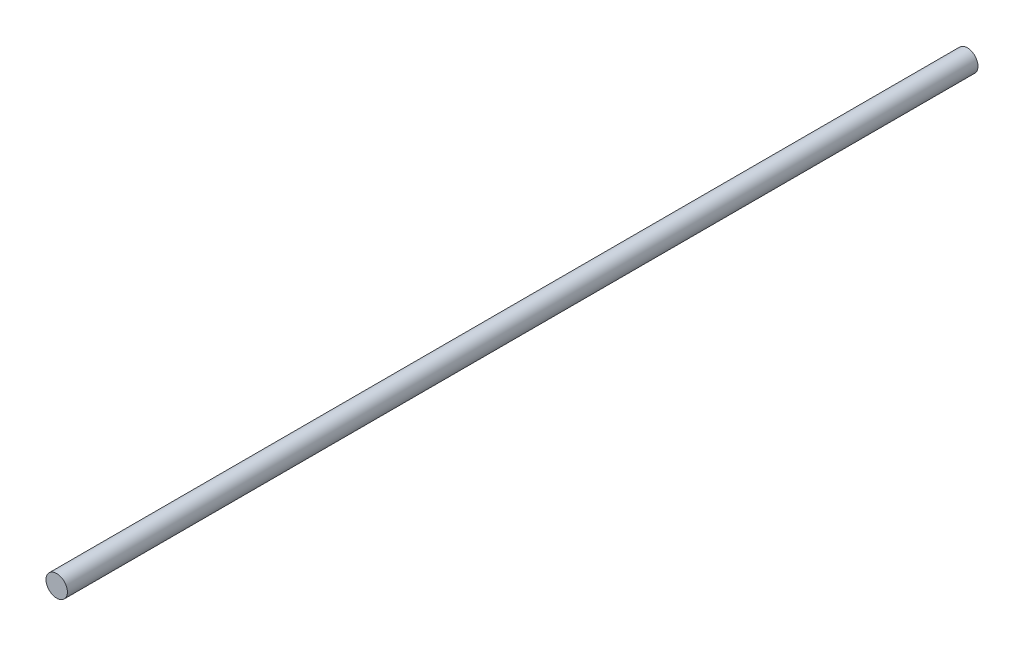
ISO-10303-21;
HEADER;
FILE_DESCRIPTION(('STEP AP214'),'2;1');
FILE_NAME('part.step','',(''),(''),'','','');
FILE_SCHEMA(('AUTOMOTIVE_DESIGN { 1 0 10303 214 1 1 1 1 }'));
ENDSEC;
DATA;
#1=APPLICATION_CONTEXT('core data for automotive mechanical design processes');
#2=APPLICATION_PROTOCOL_DEFINITION('international standard','automotive_design',2000,#1);
#3=PRODUCT_CONTEXT('',#1,'mechanical');
#4=PRODUCT('Part','Part','',(#3));
#5=PRODUCT_RELATED_PRODUCT_CATEGORY('part','',(#4));
#6=PRODUCT_DEFINITION_FORMATION('','',#4);
#7=PRODUCT_DEFINITION_CONTEXT('part definition',#1,'design');
#8=PRODUCT_DEFINITION('design','',#6,#7);
#9=PRODUCT_DEFINITION_SHAPE('','',#8);
#10=(LENGTH_UNIT() NAMED_UNIT(*) SI_UNIT(.MILLI.,.METRE.));
#11=(NAMED_UNIT(*) PLANE_ANGLE_UNIT() SI_UNIT($,.RADIAN.));
#12=(NAMED_UNIT(*) SI_UNIT($,.STERADIAN.) SOLID_ANGLE_UNIT());
#13=UNCERTAINTY_MEASURE_WITH_UNIT(LENGTH_MEASURE(1.E-05),#10,'distance_accuracy_value','');
#14=(GEOMETRIC_REPRESENTATION_CONTEXT(3) GLOBAL_UNCERTAINTY_ASSIGNED_CONTEXT((#13)) GLOBAL_UNIT_ASSIGNED_CONTEXT((#10,
#11,#12)) REPRESENTATION_CONTEXT('',''));
#15=CARTESIAN_POINT('',(0.,0.,0.));
#16=DIRECTION('',(0.,0.,1.));
#17=DIRECTION('',(1.,0.,0.));
#18=AXIS2_PLACEMENT_3D('',#15,#16,#17);
#19=CARTESIAN_POINT('',(0.,0.,270.));
#20=DIRECTION('',(0.,0.,-1.));
#21=DIRECTION('',(-1.,0.,0.));
#22=AXIS2_PLACEMENT_3D('',#19,#20,#21);
#23=CYLINDRICAL_SURFACE('',#22,3.175);
#24=CARTESIAN_POINT('',(0.,0.,270.));
#25=DIRECTION('',(0.,0.,1.));
#26=DIRECTION('',(1.,0.,0.));
#27=AXIS2_PLACEMENT_3D('',#24,#25,#26);
#28=CIRCLE('',#27,3.175);
#29=CARTESIAN_POINT('',(3.17499999999999,0.,270.));
#30=VERTEX_POINT('',#29);
#31=EDGE_CURVE('E10',#30,#30,#28,.T.);
#32=ORIENTED_EDGE('',*,*,#31,.F.);
#33=EDGE_LOOP('',(#32));
#34=FACE_BOUND('',#33,.T.);
#35=CARTESIAN_POINT('',(0.,0.,0.));
#36=DIRECTION('',(0.,0.,1.));
#37=DIRECTION('',(1.,0.,0.));
#38=AXIS2_PLACEMENT_3D('',#35,#36,#37);
#39=CIRCLE('',#38,3.175);
#40=CARTESIAN_POINT('',(3.175,0.,0.));
#41=VERTEX_POINT('',#40);
#42=EDGE_CURVE('E35',#41,#41,#39,.T.);
#43=ORIENTED_EDGE('',*,*,#42,.T.);
#44=EDGE_LOOP('',(#43));
#45=FACE_BOUND('',#44,.T.);
#46=ADVANCED_FACE('F32',(#34,#45),#23,.T.);
#47=CARTESIAN_POINT('',(0.,0.,270.));
#48=DIRECTION('',(0.,0.,1.));
#49=DIRECTION('',(1.,0.,0.));
#50=AXIS2_PLACEMENT_3D('',#47,#48,#49);
#51=PLANE('',#50);
#52=ORIENTED_EDGE('',*,*,#31,.T.);
#53=EDGE_LOOP('',(#52));
#54=FACE_BOUND('',#53,.T.);
#55=ADVANCED_FACE('F47',(#54),#51,.T.);
#56=CARTESIAN_POINT('',(0.,0.,0.));
#57=DIRECTION('',(0.,0.,1.));
#58=DIRECTION('',(1.,0.,0.));
#59=AXIS2_PLACEMENT_3D('',#56,#57,#58);
#60=PLANE('',#59);
#61=ORIENTED_EDGE('',*,*,#42,.F.);
#62=EDGE_LOOP('',(#61));
#63=FACE_BOUND('',#62,.T.);
#64=ADVANCED_FACE('F45',(#63),#60,.F.);
#65=CLOSED_SHELL('',(#46,#55,#64));
#66=MANIFOLD_SOLID_BREP('B2',#65);
#67=ADVANCED_BREP_SHAPE_REPRESENTATION('',(#18,#66),#14);
#68=SHAPE_DEFINITION_REPRESENTATION(#9,#67);
ENDSEC;
END-ISO-10303-21;
